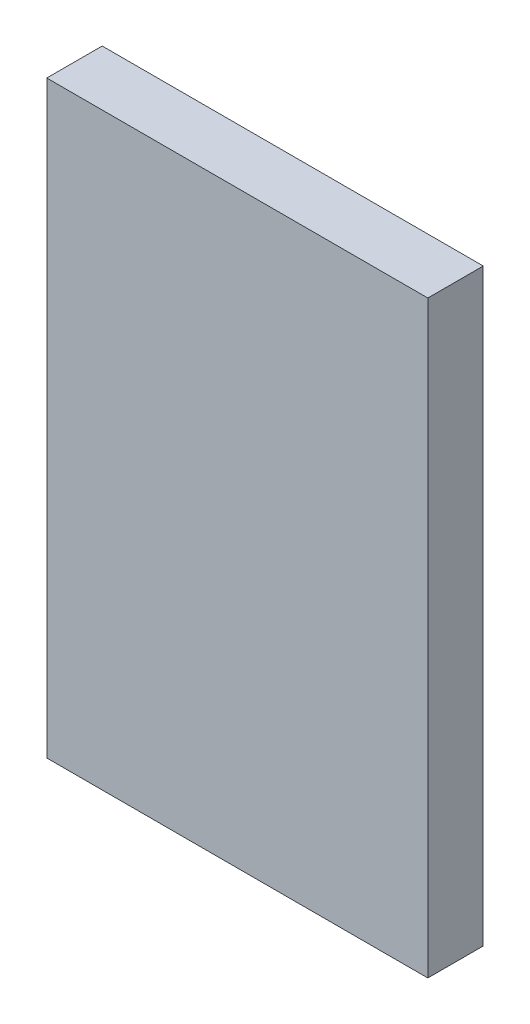
ISO-10303-21;
HEADER;
FILE_DESCRIPTION(('STEP AP214'),'2;1');
FILE_NAME('part.step','',(''),(''),'','','');
FILE_SCHEMA(('AUTOMOTIVE_DESIGN { 1 0 10303 214 1 1 1 1 }'));
ENDSEC;
DATA;
#1=APPLICATION_CONTEXT('core data for automotive mechanical design processes');
#2=APPLICATION_PROTOCOL_DEFINITION('international standard','automotive_design',2000,#1);
#3=PRODUCT_CONTEXT('',#1,'mechanical');
#4=PRODUCT('Part','Part','',(#3));
#5=PRODUCT_RELATED_PRODUCT_CATEGORY('part','',(#4));
#6=PRODUCT_DEFINITION_FORMATION('','',#4);
#7=PRODUCT_DEFINITION_CONTEXT('part definition',#1,'design');
#8=PRODUCT_DEFINITION('design','',#6,#7);
#9=PRODUCT_DEFINITION_SHAPE('','',#8);
#10=(LENGTH_UNIT() NAMED_UNIT(*) SI_UNIT(.MILLI.,.METRE.));
#11=(NAMED_UNIT(*) PLANE_ANGLE_UNIT() SI_UNIT($,.RADIAN.));
#12=(NAMED_UNIT(*) SI_UNIT($,.STERADIAN.) SOLID_ANGLE_UNIT());
#13=UNCERTAINTY_MEASURE_WITH_UNIT(LENGTH_MEASURE(1.E-05),#10,'distance_accuracy_value','');
#14=(GEOMETRIC_REPRESENTATION_CONTEXT(3) GLOBAL_UNCERTAINTY_ASSIGNED_CONTEXT((#13)) GLOBAL_UNIT_ASSIGNED_CONTEXT((#10,
#11,#12)) REPRESENTATION_CONTEXT('',''));
#15=CARTESIAN_POINT('',(0.,0.,0.));
#16=DIRECTION('',(0.,0.,1.));
#17=DIRECTION('',(1.,0.,0.));
#18=AXIS2_PLACEMENT_3D('',#15,#16,#17);
#19=CARTESIAN_POINT('',(0.,6.,5.));
#20=DIRECTION('',(-0.737154140200741,-0.675724628517347,0.));
#21=DIRECTION('',(0.675724628517347,-0.737154140200741,0.));
#22=AXIS2_PLACEMENT_3D('',#19,#20,#21);
#23=PLANE('',#22);
#24=DIRECTION('',(0.,0.,-1.));
#25=VECTOR('',#24,1.);
#26=CARTESIAN_POINT('',(5.50000000000001,0.,5.));
#27=LINE('',#26,#25);
#28=CARTESIAN_POINT('',(5.50000000000001,0.,2.));
#29=VERTEX_POINT('',#28);
#30=CARTESIAN_POINT('',(5.50000000000001,0.,0.));
#31=VERTEX_POINT('',#30);
#32=EDGE_CURVE('E64',#29,#31,#27,.T.);
#33=ORIENTED_EDGE('',*,*,#32,.F.);
#34=DIRECTION('',(-0.675724628517347,0.737154140200741,0.));
#35=VECTOR('',#34,1.);
#36=CARTESIAN_POINT('',(5.50000000000001,0.,2.));
#37=LINE('',#36,#35);
#38=CARTESIAN_POINT('',(0.,6.,2.));
#39=VERTEX_POINT('',#38);
#40=EDGE_CURVE('E57',#29,#39,#37,.T.);
#41=ORIENTED_EDGE('',*,*,#40,.T.);
#42=DIRECTION('',(0.,0.,-1.));
#43=VECTOR('',#42,1.);
#44=CARTESIAN_POINT('',(0.,6.,5.));
#45=LINE('',#44,#43);
#46=CARTESIAN_POINT('',(0.,6.,0.));
#47=VERTEX_POINT('',#46);
#48=EDGE_CURVE('E203',#39,#47,#45,.T.);
#49=ORIENTED_EDGE('',*,*,#48,.T.);
#50=DIRECTION('',(-0.675724628517347,0.737154140200741,0.));
#51=VECTOR('',#50,1.);
#52=CARTESIAN_POINT('',(0.,6.,0.));
#53=LINE('',#52,#51);
#54=EDGE_CURVE('E179',#31,#47,#53,.T.);
#55=ORIENTED_EDGE('',*,*,#54,.F.);
#56=EDGE_LOOP('',(#33,#41,#49,#55));
#57=FACE_BOUND('',#56,.T.);
#58=ADVANCED_FACE('F41',(#57),#23,.T.);
#59=CARTESIAN_POINT('',(0.,6.,5.));
#60=DIRECTION('',(0.737154140200741,-0.675724628517346,0.));
#61=DIRECTION('',(0.675724628517346,0.737154140200741,0.));
#62=AXIS2_PLACEMENT_3D('',#59,#60,#61);
#63=PLANE('',#62);
#64=ORIENTED_EDGE('',*,*,#48,.F.);
#65=DIRECTION('',(-0.675724628517346,-0.737154140200742,0.));
#66=VECTOR('',#65,1.);
#67=CARTESIAN_POINT('',(0.,6.,2.));
#68=LINE('',#67,#66);
#69=CARTESIAN_POINT('',(-5.5,0.,2.));
#70=VERTEX_POINT('',#69);
#71=EDGE_CURVE('E175',#39,#70,#68,.T.);
#72=ORIENTED_EDGE('',*,*,#71,.T.);
#73=DIRECTION('',(0.,0.,-1.));
#74=VECTOR('',#73,1.);
#75=CARTESIAN_POINT('',(-5.5,0.,5.));
#76=LINE('',#75,#74);
#77=CARTESIAN_POINT('',(-5.5,0.,0.));
#78=VERTEX_POINT('',#77);
#79=EDGE_CURVE('E200',#70,#78,#76,.T.);
#80=ORIENTED_EDGE('',*,*,#79,.T.);
#81=DIRECTION('',(-0.675724628517346,-0.737154140200742,0.));
#82=VECTOR('',#81,1.);
#83=CARTESIAN_POINT('',(0.,6.,0.));
#84=LINE('',#83,#82);
#85=EDGE_CURVE('E183',#47,#78,#84,.T.);
#86=ORIENTED_EDGE('',*,*,#85,.F.);
#87=EDGE_LOOP('',(#64,#72,#80,#86));
#88=FACE_BOUND('',#87,.T.);
#89=ADVANCED_FACE('F270',(#88),#63,.T.);
#90=CARTESIAN_POINT('',(0.,-6.,5.));
#91=DIRECTION('',(0.737154140200741,0.675724628517346,0.));
#92=DIRECTION('',(-0.675724628517346,0.737154140200741,0.));
#93=AXIS2_PLACEMENT_3D('',#90,#91,#92);
#94=PLANE('',#93);
#95=ORIENTED_EDGE('',*,*,#79,.F.);
#96=DIRECTION('',(0.675724628517346,-0.737154140200741,0.));
#97=VECTOR('',#96,1.);
#98=CARTESIAN_POINT('',(-5.5,0.,2.));
#99=LINE('',#98,#97);
#100=CARTESIAN_POINT('',(0.,-6.,2.));
#101=VERTEX_POINT('',#100);
#102=EDGE_CURVE('E160',#70,#101,#99,.T.);
#103=ORIENTED_EDGE('',*,*,#102,.T.);
#104=DIRECTION('',(0.,0.,-1.));
#105=VECTOR('',#104,1.);
#106=CARTESIAN_POINT('',(0.,-6.,5.));
#107=LINE('',#106,#105);
#108=CARTESIAN_POINT('',(0.,-6.,0.));
#109=VERTEX_POINT('',#108);
#110=EDGE_CURVE('E197',#101,#109,#107,.T.);
#111=ORIENTED_EDGE('',*,*,#110,.T.);
#112=DIRECTION('',(0.675724628517346,-0.737154140200741,0.));
#113=VECTOR('',#112,1.);
#114=CARTESIAN_POINT('',(0.,-6.,0.));
#115=LINE('',#114,#113);
#116=EDGE_CURVE('E187',#78,#109,#115,.T.);
#117=ORIENTED_EDGE('',*,*,#116,.F.);
#118=EDGE_LOOP('',(#95,#103,#111,#117));
#119=FACE_BOUND('',#118,.T.);
#120=ADVANCED_FACE('F276',(#119),#94,.T.);
#121=CARTESIAN_POINT('',(0.,-6.,5.));
#122=DIRECTION('',(-0.737154140200741,0.675724628517347,0.));
#123=DIRECTION('',(-0.675724628517347,-0.737154140200741,0.));
#124=AXIS2_PLACEMENT_3D('',#121,#122,#123);
#125=PLANE('',#124);
#126=ORIENTED_EDGE('',*,*,#110,.F.);
#127=DIRECTION('',(0.675724628517347,0.737154140200741,0.));
#128=VECTOR('',#127,1.);
#129=CARTESIAN_POINT('',(0.,-6.,2.));
#130=LINE('',#129,#128);
#131=EDGE_CURVE('E165',#101,#29,#130,.T.);
#132=ORIENTED_EDGE('',*,*,#131,.T.);
#133=ORIENTED_EDGE('',*,*,#32,.T.);
#134=DIRECTION('',(0.675724628517347,0.737154140200741,0.));
#135=VECTOR('',#134,1.);
#136=CARTESIAN_POINT('',(0.,-6.,0.));
#137=LINE('',#136,#135);
#138=EDGE_CURVE('E191',#109,#31,#137,.T.);
#139=ORIENTED_EDGE('',*,*,#138,.F.);
#140=EDGE_LOOP('',(#126,#132,#133,#139));
#141=FACE_BOUND('',#140,.T.);
#142=ADVANCED_FACE('F283',(#141),#125,.T.);
#143=CARTESIAN_POINT('',(0.,0.,0.));
#144=DIRECTION('',(0.,0.,1.));
#145=DIRECTION('',(1.,0.,0.));
#146=AXIS2_PLACEMENT_3D('',#143,#144,#145);
#147=PLANE('',#146);
#148=DIRECTION('',(0.,-1.,0.));
#149=VECTOR('',#148,1.);
#150=CARTESIAN_POINT('',(-11.5,-27.,0.));
#151=LINE('',#150,#149);
#152=CARTESIAN_POINT('',(-11.5,27.,0.));
#153=VERTEX_POINT('',#152);
#154=CARTESIAN_POINT('',(-11.5,-27.,0.));
#155=VERTEX_POINT('',#154);
#156=EDGE_CURVE('E206',#153,#155,#151,.T.);
#157=ORIENTED_EDGE('',*,*,#156,.F.);
#158=DIRECTION('',(-1.,0.,0.));
#159=VECTOR('',#158,1.);
#160=CARTESIAN_POINT('',(11.5,27.,0.));
#161=LINE('',#160,#159);
#162=CARTESIAN_POINT('',(11.5,27.,0.));
#163=VERTEX_POINT('',#162);
#164=EDGE_CURVE('E212',#163,#153,#161,.T.);
#165=ORIENTED_EDGE('',*,*,#164,.F.);
#166=DIRECTION('',(0.,1.,0.));
#167=VECTOR('',#166,1.);
#168=CARTESIAN_POINT('',(11.5,-27.,0.));
#169=LINE('',#168,#167);
#170=CARTESIAN_POINT('',(11.5,-27.,0.));
#171=VERTEX_POINT('',#170);
#172=EDGE_CURVE('E231',#171,#163,#169,.T.);
#173=ORIENTED_EDGE('',*,*,#172,.F.);
#174=DIRECTION('',(1.,0.,0.));
#175=VECTOR('',#174,1.);
#176=CARTESIAN_POINT('',(11.5,-27.,0.));
#177=LINE('',#176,#175);
#178=EDGE_CURVE('E228',#155,#171,#177,.T.);
#179=ORIENTED_EDGE('',*,*,#178,.F.);
#180=EDGE_LOOP('',(#157,#165,#173,#179));
#181=FACE_BOUND('',#180,.T.);
#182=ORIENTED_EDGE('',*,*,#54,.T.);
#183=ORIENTED_EDGE('',*,*,#85,.T.);
#184=ORIENTED_EDGE('',*,*,#116,.T.);
#185=ORIENTED_EDGE('',*,*,#138,.T.);
#186=EDGE_LOOP('',(#182,#183,#184,#185));
#187=FACE_BOUND('',#186,.T.);
#188=ADVANCED_FACE('F252',(#181,#187),#147,.F.);
#189=CARTESIAN_POINT('',(-11.5,-27.,5.));
#190=DIRECTION('',(1.,0.,0.));
#191=DIRECTION('',(0.,0.,-1.));
#192=AXIS2_PLACEMENT_3D('',#189,#190,#191);
#193=PLANE('',#192);
#194=ORIENTED_EDGE('',*,*,#156,.T.);
#195=DIRECTION('',(0.,0.,-1.));
#196=VECTOR('',#195,1.);
#197=CARTESIAN_POINT('',(-11.5,-27.,5.));
#198=LINE('',#197,#196);
#199=CARTESIAN_POINT('',(-11.5,-27.,5.));
#200=VERTEX_POINT('',#199);
#201=EDGE_CURVE('E11',#200,#155,#198,.T.);
#202=ORIENTED_EDGE('',*,*,#201,.F.);
#203=DIRECTION('',(0.,-1.,0.));
#204=VECTOR('',#203,1.);
#205=CARTESIAN_POINT('',(-11.5,-27.,5.));
#206=LINE('',#205,#204);
#207=CARTESIAN_POINT('',(-11.5,27.,5.));
#208=VERTEX_POINT('',#207);
#209=EDGE_CURVE('E207',#208,#200,#206,.T.);
#210=ORIENTED_EDGE('',*,*,#209,.F.);
#211=DIRECTION('',(0.,0.,-1.));
#212=VECTOR('',#211,1.);
#213=CARTESIAN_POINT('',(-11.5,27.,5.));
#214=LINE('',#213,#212);
#215=EDGE_CURVE('E224',#208,#153,#214,.T.);
#216=ORIENTED_EDGE('',*,*,#215,.T.);
#217=EDGE_LOOP('',(#194,#202,#210,#216));
#218=FACE_BOUND('',#217,.T.);
#219=ADVANCED_FACE('F43',(#218),#193,.F.);
#220=CARTESIAN_POINT('',(11.5,-27.,5.));
#221=DIRECTION('',(0.,1.,0.));
#222=DIRECTION('',(0.,0.,1.));
#223=AXIS2_PLACEMENT_3D('',#220,#221,#222);
#224=PLANE('',#223);
#225=ORIENTED_EDGE('',*,*,#178,.T.);
#226=DIRECTION('',(0.,0.,-1.));
#227=VECTOR('',#226,1.);
#228=CARTESIAN_POINT('',(11.5,-27.,5.));
#229=LINE('',#228,#227);
#230=CARTESIAN_POINT('',(11.5,-27.,5.));
#231=VERTEX_POINT('',#230);
#232=EDGE_CURVE('E50',#231,#171,#229,.T.);
#233=ORIENTED_EDGE('',*,*,#232,.F.);
#234=DIRECTION('',(1.,0.,0.));
#235=VECTOR('',#234,1.);
#236=CARTESIAN_POINT('',(11.5,-27.,5.));
#237=LINE('',#236,#235);
#238=EDGE_CURVE('E211',#200,#231,#237,.T.);
#239=ORIENTED_EDGE('',*,*,#238,.F.);
#240=ORIENTED_EDGE('',*,*,#201,.T.);
#241=EDGE_LOOP('',(#225,#233,#239,#240));
#242=FACE_BOUND('',#241,.T.);
#243=ADVANCED_FACE('F262',(#242),#224,.F.);
#244=CARTESIAN_POINT('',(11.5,-27.,5.));
#245=DIRECTION('',(-1.,0.,0.));
#246=DIRECTION('',(0.,0.,1.));
#247=AXIS2_PLACEMENT_3D('',#244,#245,#246);
#248=PLANE('',#247);
#249=ORIENTED_EDGE('',*,*,#172,.T.);
#250=DIRECTION('',(0.,0.,-1.));
#251=VECTOR('',#250,1.);
#252=CARTESIAN_POINT('',(11.5,27.,5.));
#253=LINE('',#252,#251);
#254=CARTESIAN_POINT('',(11.5,27.,5.));
#255=VERTEX_POINT('',#254);
#256=EDGE_CURVE('E239',#255,#163,#253,.T.);
#257=ORIENTED_EDGE('',*,*,#256,.F.);
#258=DIRECTION('',(0.,1.,0.));
#259=VECTOR('',#258,1.);
#260=CARTESIAN_POINT('',(11.5,-27.,5.));
#261=LINE('',#260,#259);
#262=EDGE_CURVE('E216',#231,#255,#261,.T.);
#263=ORIENTED_EDGE('',*,*,#262,.F.);
#264=ORIENTED_EDGE('',*,*,#232,.T.);
#265=EDGE_LOOP('',(#249,#257,#263,#264));
#266=FACE_BOUND('',#265,.T.);
#267=ADVANCED_FACE('F247',(#266),#248,.F.);
#268=CARTESIAN_POINT('',(11.5,27.,5.));
#269=DIRECTION('',(0.,-1.,0.));
#270=DIRECTION('',(0.,0.,-1.));
#271=AXIS2_PLACEMENT_3D('',#268,#269,#270);
#272=PLANE('',#271);
#273=ORIENTED_EDGE('',*,*,#164,.T.);
#274=ORIENTED_EDGE('',*,*,#215,.F.);
#275=DIRECTION('',(-1.,0.,0.));
#276=VECTOR('',#275,1.);
#277=CARTESIAN_POINT('',(11.5,27.,5.));
#278=LINE('',#277,#276);
#279=EDGE_CURVE('E220',#255,#208,#278,.T.);
#280=ORIENTED_EDGE('',*,*,#279,.F.);
#281=ORIENTED_EDGE('',*,*,#256,.T.);
#282=EDGE_LOOP('',(#273,#274,#280,#281));
#283=FACE_BOUND('',#282,.T.);
#284=ADVANCED_FACE('F256',(#283),#272,.F.);
#285=CARTESIAN_POINT('',(0.,0.,2.));
#286=DIRECTION('',(0.,0.,1.));
#287=DIRECTION('',(1.,0.,0.));
#288=AXIS2_PLACEMENT_3D('',#285,#286,#287);
#289=PLANE('',#288);
#290=ORIENTED_EDGE('',*,*,#102,.F.);
#291=ORIENTED_EDGE('',*,*,#71,.F.);
#292=ORIENTED_EDGE('',*,*,#40,.F.);
#293=ORIENTED_EDGE('',*,*,#131,.F.);
#294=EDGE_LOOP('',(#290,#291,#292,#293));
#295=FACE_BOUND('',#294,.T.);
#296=ADVANCED_FACE('F285',(#295),#289,.F.);
#297=CARTESIAN_POINT('',(0.,0.,5.));
#298=DIRECTION('',(0.,0.,1.));
#299=DIRECTION('',(1.,0.,0.));
#300=AXIS2_PLACEMENT_3D('',#297,#298,#299);
#301=PLANE('',#300);
#302=DIRECTION('',(0.,-1.,0.));
#303=VECTOR('',#302,1.);
#304=CARTESIAN_POINT('',(-27.5,-42.5,5.));
#305=LINE('',#304,#303);
#306=CARTESIAN_POINT('',(-27.5,42.5,5.));
#307=VERTEX_POINT('',#306);
#308=CARTESIAN_POINT('',(-27.5,-42.5,5.));
#309=VERTEX_POINT('',#308);
#310=EDGE_CURVE('E158',#307,#309,#305,.T.);
#311=ORIENTED_EDGE('',*,*,#310,.F.);
#312=DIRECTION('',(-1.,0.,0.));
#313=VECTOR('',#312,1.);
#314=CARTESIAN_POINT('',(27.5,42.5,5.));
#315=LINE('',#314,#313);
#316=CARTESIAN_POINT('',(27.5,42.5,5.));
#317=VERTEX_POINT('',#316);
#318=EDGE_CURVE('E154',#317,#307,#315,.T.);
#319=ORIENTED_EDGE('',*,*,#318,.F.);
#320=DIRECTION('',(0.,1.,0.));
#321=VECTOR('',#320,1.);
#322=CARTESIAN_POINT('',(27.5,-42.5,5.));
#323=LINE('',#322,#321);
#324=CARTESIAN_POINT('',(27.5,-42.5,5.));
#325=VERTEX_POINT('',#324);
#326=EDGE_CURVE('E413',#325,#317,#323,.T.);
#327=ORIENTED_EDGE('',*,*,#326,.F.);
#328=DIRECTION('',(1.,0.,0.));
#329=VECTOR('',#328,1.);
#330=CARTESIAN_POINT('',(27.5,-42.5,5.));
#331=LINE('',#330,#329);
#332=EDGE_CURVE('E417',#309,#325,#331,.T.);
#333=ORIENTED_EDGE('',*,*,#332,.F.);
#334=EDGE_LOOP('',(#311,#319,#327,#333));
#335=FACE_BOUND('',#334,.T.);
#336=ORIENTED_EDGE('',*,*,#279,.T.);
#337=ORIENTED_EDGE('',*,*,#209,.T.);
#338=ORIENTED_EDGE('',*,*,#238,.T.);
#339=ORIENTED_EDGE('',*,*,#262,.T.);
#340=EDGE_LOOP('',(#336,#337,#338,#339));
#341=FACE_BOUND('',#340,.T.);
#342=ADVANCED_FACE('F261',(#335,#341),#301,.F.);
#343=CARTESIAN_POINT('',(-27.5,-42.5,13.));
#344=DIRECTION('',(1.,0.,0.));
#345=DIRECTION('',(0.,0.,-1.));
#346=AXIS2_PLACEMENT_3D('',#343,#344,#345);
#347=PLANE('',#346);
#348=ORIENTED_EDGE('',*,*,#310,.T.);
#349=DIRECTION('',(0.,0.,-1.));
#350=VECTOR('',#349,1.);
#351=CARTESIAN_POINT('',(-27.5,-42.5,13.));
#352=LINE('',#351,#350);
#353=CARTESIAN_POINT('',(-27.5,-42.5,13.));
#354=VERTEX_POINT('',#353);
#355=EDGE_CURVE('E136',#354,#309,#352,.T.);
#356=ORIENTED_EDGE('',*,*,#355,.F.);
#357=DIRECTION('',(0.,-1.,0.));
#358=VECTOR('',#357,1.);
#359=CARTESIAN_POINT('',(-27.5,-42.5,13.));
#360=LINE('',#359,#358);
#361=CARTESIAN_POINT('',(-27.5,42.5,13.));
#362=VERTEX_POINT('',#361);
#363=EDGE_CURVE('E144',#362,#354,#360,.T.);
#364=ORIENTED_EDGE('',*,*,#363,.F.);
#365=DIRECTION('',(0.,0.,-1.));
#366=VECTOR('',#365,1.);
#367=CARTESIAN_POINT('',(-27.5,42.5,13.));
#368=LINE('',#367,#366);
#369=EDGE_CURVE('E409',#362,#307,#368,.T.);
#370=ORIENTED_EDGE('',*,*,#369,.T.);
#371=EDGE_LOOP('',(#348,#356,#364,#370));
#372=FACE_BOUND('',#371,.T.);
#373=ADVANCED_FACE('F156',(#372),#347,.F.);
#374=CARTESIAN_POINT('',(27.5,-42.5,13.));
#375=DIRECTION('',(0.,1.,0.));
#376=DIRECTION('',(0.,0.,1.));
#377=AXIS2_PLACEMENT_3D('',#374,#375,#376);
#378=PLANE('',#377);
#379=ORIENTED_EDGE('',*,*,#332,.T.);
#380=DIRECTION('',(0.,0.,-1.));
#381=VECTOR('',#380,1.);
#382=CARTESIAN_POINT('',(27.5,-42.5,13.));
#383=LINE('',#382,#381);
#384=CARTESIAN_POINT('',(27.5,-42.5,13.));
#385=VERTEX_POINT('',#384);
#386=EDGE_CURVE('E139',#385,#325,#383,.T.);
#387=ORIENTED_EDGE('',*,*,#386,.F.);
#388=DIRECTION('',(1.,0.,0.));
#389=VECTOR('',#388,1.);
#390=CARTESIAN_POINT('',(27.5,-42.5,13.));
#391=LINE('',#390,#389);
#392=EDGE_CURVE('E132',#354,#385,#391,.T.);
#393=ORIENTED_EDGE('',*,*,#392,.F.);
#394=ORIENTED_EDGE('',*,*,#355,.T.);
#395=EDGE_LOOP('',(#379,#387,#393,#394));
#396=FACE_BOUND('',#395,.T.);
#397=ADVANCED_FACE('F134',(#396),#378,.F.);
#398=CARTESIAN_POINT('',(27.5,-42.5,13.));
#399=DIRECTION('',(-1.,0.,0.));
#400=DIRECTION('',(0.,0.,1.));
#401=AXIS2_PLACEMENT_3D('',#398,#399,#400);
#402=PLANE('',#401);
#403=ORIENTED_EDGE('',*,*,#326,.T.);
#404=DIRECTION('',(0.,0.,-1.));
#405=VECTOR('',#404,1.);
#406=CARTESIAN_POINT('',(27.5,42.5,13.));
#407=LINE('',#406,#405);
#408=CARTESIAN_POINT('',(27.5,42.5,13.));
#409=VERTEX_POINT('',#408);
#410=EDGE_CURVE('E167',#409,#317,#407,.T.);
#411=ORIENTED_EDGE('',*,*,#410,.F.);
#412=DIRECTION('',(0.,1.,0.));
#413=VECTOR('',#412,1.);
#414=CARTESIAN_POINT('',(27.5,-42.5,13.));
#415=LINE('',#414,#413);
#416=EDGE_CURVE('E143',#385,#409,#415,.T.);
#417=ORIENTED_EDGE('',*,*,#416,.F.);
#418=ORIENTED_EDGE('',*,*,#386,.T.);
#419=EDGE_LOOP('',(#403,#411,#417,#418));
#420=FACE_BOUND('',#419,.T.);
#421=ADVANCED_FACE('F376',(#420),#402,.F.);
#422=CARTESIAN_POINT('',(27.5,42.5,13.));
#423=DIRECTION('',(0.,-1.,0.));
#424=DIRECTION('',(0.,0.,-1.));
#425=AXIS2_PLACEMENT_3D('',#422,#423,#424);
#426=PLANE('',#425);
#427=ORIENTED_EDGE('',*,*,#318,.T.);
#428=ORIENTED_EDGE('',*,*,#369,.F.);
#429=DIRECTION('',(-1.,0.,0.));
#430=VECTOR('',#429,1.);
#431=CARTESIAN_POINT('',(27.5,42.5,13.));
#432=LINE('',#431,#430);
#433=EDGE_CURVE('E149',#409,#362,#432,.T.);
#434=ORIENTED_EDGE('',*,*,#433,.F.);
#435=ORIENTED_EDGE('',*,*,#410,.T.);
#436=EDGE_LOOP('',(#427,#428,#434,#435));
#437=FACE_BOUND('',#436,.T.);
#438=ADVANCED_FACE('F383',(#437),#426,.F.);
#439=CARTESIAN_POINT('',(0.,0.,13.));
#440=DIRECTION('',(0.,0.,1.));
#441=DIRECTION('',(1.,0.,0.));
#442=AXIS2_PLACEMENT_3D('',#439,#440,#441);
#443=PLANE('',#442);
#444=ORIENTED_EDGE('',*,*,#363,.T.);
#445=ORIENTED_EDGE('',*,*,#392,.T.);
#446=ORIENTED_EDGE('',*,*,#416,.T.);
#447=ORIENTED_EDGE('',*,*,#433,.T.);
#448=EDGE_LOOP('',(#444,#445,#446,#447));
#449=FACE_BOUND('',#448,.T.);
#450=ADVANCED_FACE('F147',(#449),#443,.T.);
#451=CLOSED_SHELL('',(#58,#89,#120,#142,#188,#219,#243,#267,#284,#296,#342,#373,#397,#421,#438,#450));
#452=MANIFOLD_SOLID_BREP('B2',#451);
#453=ADVANCED_BREP_SHAPE_REPRESENTATION('',(#18,#452),#14);
#454=SHAPE_DEFINITION_REPRESENTATION(#9,#453);
ENDSEC;
END-ISO-10303-21;
